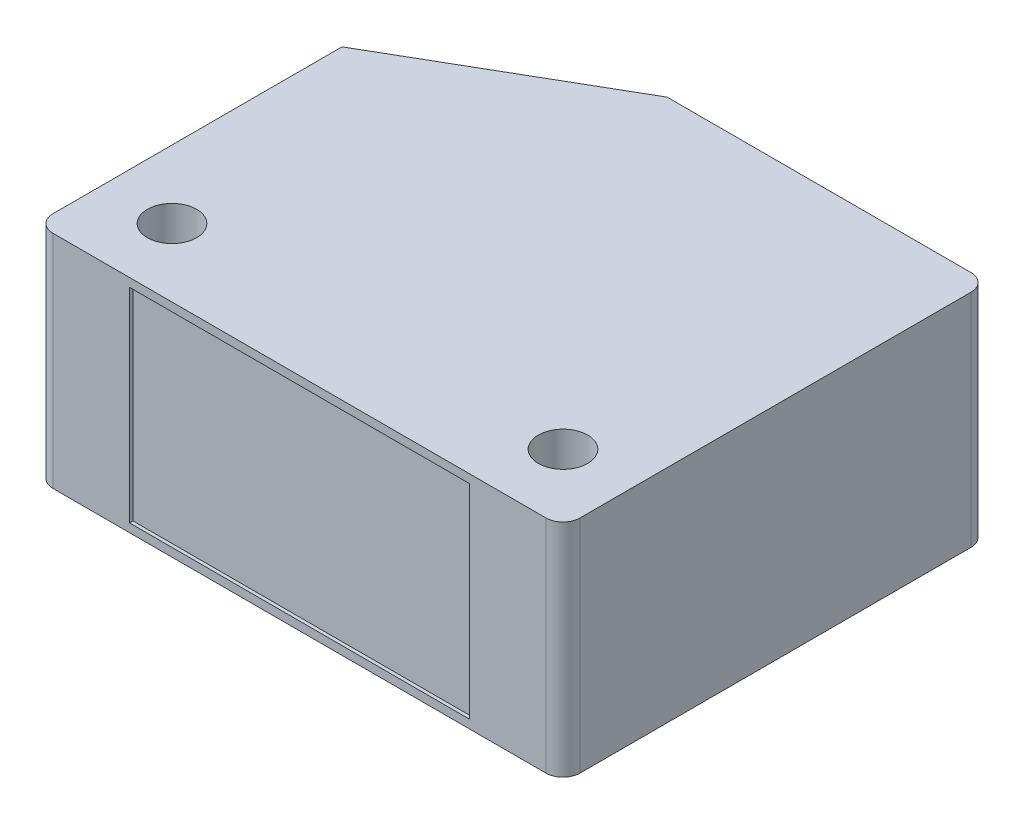
ISO-10303-21;
HEADER;
FILE_DESCRIPTION(('STEP AP214'),'2;1');
FILE_NAME('part.step','',(''),(''),'','','');
FILE_SCHEMA(('AUTOMOTIVE_DESIGN { 1 0 10303 214 1 1 1 1 }'));
ENDSEC;
DATA;
#1=APPLICATION_CONTEXT('core data for automotive mechanical design processes');
#2=APPLICATION_PROTOCOL_DEFINITION('international standard','automotive_design',2000,#1);
#3=PRODUCT_CONTEXT('',#1,'mechanical');
#4=PRODUCT('Part','Part','',(#3));
#5=PRODUCT_RELATED_PRODUCT_CATEGORY('part','',(#4));
#6=PRODUCT_DEFINITION_FORMATION('','',#4);
#7=PRODUCT_DEFINITION_CONTEXT('part definition',#1,'design');
#8=PRODUCT_DEFINITION('design','',#6,#7);
#9=PRODUCT_DEFINITION_SHAPE('','',#8);
#10=(LENGTH_UNIT() NAMED_UNIT(*) SI_UNIT(.MILLI.,.METRE.));
#11=(NAMED_UNIT(*) PLANE_ANGLE_UNIT() SI_UNIT($,.RADIAN.));
#12=(NAMED_UNIT(*) SI_UNIT($,.STERADIAN.) SOLID_ANGLE_UNIT());
#13=UNCERTAINTY_MEASURE_WITH_UNIT(LENGTH_MEASURE(1.E-05),#10,'distance_accuracy_value','');
#14=(GEOMETRIC_REPRESENTATION_CONTEXT(3) GLOBAL_UNCERTAINTY_ASSIGNED_CONTEXT((#13)) GLOBAL_UNIT_ASSIGNED_CONTEXT((#10,
#11,#12)) REPRESENTATION_CONTEXT('',''));
#15=CARTESIAN_POINT('',(0.,0.,0.));
#16=DIRECTION('',(0.,0.,1.));
#17=DIRECTION('',(1.,0.,0.));
#18=AXIS2_PLACEMENT_3D('',#15,#16,#17);
#19=CARTESIAN_POINT('',(0.,13.,0.));
#20=DIRECTION('',(0.,1.,0.));
#21=DIRECTION('',(0.,0.,1.));
#22=AXIS2_PLACEMENT_3D('',#19,#20,#21);
#23=PLANE('',#22);
#24=DIRECTION('',(0.,0.,1.));
#25=VECTOR('',#24,1.);
#26=CARTESIAN_POINT('',(-15.5,13.,-11.0605162708835));
#27=LINE('',#26,#25);
#28=CARTESIAN_POINT('',(-15.5,13.,-4.06051627088352));
#29=VERTEX_POINT('',#28);
#30=CARTESIAN_POINT('',(-15.5,13.,12.9394837291165));
#31=VERTEX_POINT('',#30);
#32=EDGE_CURVE('E206',#29,#31,#27,.T.);
#33=ORIENTED_EDGE('',*,*,#32,.T.);
#34=CARTESIAN_POINT('',(-14.5,13.,12.9394837291165));
#35=DIRECTION('',(0.,1.,0.));
#36=DIRECTION('',(0.,0.,1.));
#37=AXIS2_PLACEMENT_3D('',#34,#35,#36);
#38=CIRCLE('',#37,1.);
#39=CARTESIAN_POINT('',(-14.5,13.,13.9394837291165));
#40=VERTEX_POINT('',#39);
#41=EDGE_CURVE('E232',#31,#40,#38,.T.);
#42=ORIENTED_EDGE('',*,*,#41,.T.);
#43=DIRECTION('',(1.,0.,0.));
#44=VECTOR('',#43,1.);
#45=CARTESIAN_POINT('',(-15.5,13.,13.9394837291165));
#46=LINE('',#45,#44);
#47=CARTESIAN_POINT('',(14.5,13.,13.9394837291165));
#48=VERTEX_POINT('',#47);
#49=EDGE_CURVE('E209',#40,#48,#46,.T.);
#50=ORIENTED_EDGE('',*,*,#49,.T.);
#51=CARTESIAN_POINT('',(14.5,13.,12.9394837291165));
#52=DIRECTION('',(0.,1.,0.));
#53=DIRECTION('',(0.,0.,1.));
#54=AXIS2_PLACEMENT_3D('',#51,#52,#53);
#55=CIRCLE('',#54,1.);
#56=CARTESIAN_POINT('',(15.5,13.,12.9394837291165));
#57=VERTEX_POINT('',#56);
#58=EDGE_CURVE('E229',#48,#57,#55,.T.);
#59=ORIENTED_EDGE('',*,*,#58,.T.);
#60=DIRECTION('',(0.,0.,-1.));
#61=VECTOR('',#60,1.);
#62=CARTESIAN_POINT('',(15.5,13.,-11.0605162708835));
#63=LINE('',#62,#61);
#64=CARTESIAN_POINT('',(15.5,13.,-10.0605162708835));
#65=VERTEX_POINT('',#64);
#66=EDGE_CURVE('E201',#57,#65,#63,.T.);
#67=ORIENTED_EDGE('',*,*,#66,.T.);
#68=CARTESIAN_POINT('',(14.5,13.,-10.0605162708835));
#69=DIRECTION('',(0.,1.,0.));
#70=DIRECTION('',(0.,0.,1.));
#71=AXIS2_PLACEMENT_3D('',#68,#69,#70);
#72=CIRCLE('',#71,1.);
#73=CARTESIAN_POINT('',(14.5,13.,-11.0605162708835));
#74=VERTEX_POINT('',#73);
#75=EDGE_CURVE('E53',#65,#74,#72,.T.);
#76=ORIENTED_EDGE('',*,*,#75,.T.);
#77=DIRECTION('',(-1.,0.,0.));
#78=VECTOR('',#77,1.);
#79=CARTESIAN_POINT('',(-15.5,13.,-11.0605162708835));
#80=LINE('',#79,#78);
#81=CARTESIAN_POINT('',(-3.37564434701791,13.,-11.0605162708835));
#82=VERTEX_POINT('',#81);
#83=EDGE_CURVE('E203',#74,#82,#80,.T.);
#84=ORIENTED_EDGE('',*,*,#83,.T.);
#85=DIRECTION('',(0.866025403784438,0.,-0.500000000000001));
#86=VECTOR('',#85,1.);
#87=CARTESIAN_POINT('',(-15.5,13.,-4.06051627088352));
#88=LINE('',#87,#86);
#89=EDGE_CURVE('E145',#29,#82,#88,.T.);
#90=ORIENTED_EDGE('',*,*,#89,.F.);
#91=EDGE_LOOP('',(#33,#42,#50,#59,#67,#76,#84,#90));
#92=FACE_BOUND('',#91,.T.);
#93=CARTESIAN_POINT('',(-11.5,13.,9.93948372911649));
#94=DIRECTION('',(0.,1.,0.));
#95=DIRECTION('',(0.,0.,1.));
#96=AXIS2_PLACEMENT_3D('',#93,#94,#95);
#97=CIRCLE('',#96,1.45);
#98=CARTESIAN_POINT('',(-11.5,13.,11.3894837291165));
#99=VERTEX_POINT('',#98);
#100=EDGE_CURVE('E196',#99,#99,#97,.T.);
#101=ORIENTED_EDGE('',*,*,#100,.F.);
#102=EDGE_LOOP('',(#101));
#103=FACE_BOUND('',#102,.T.);
#104=CARTESIAN_POINT('',(11.5,13.,9.93948372911649));
#105=DIRECTION('',(0.,1.,0.));
#106=DIRECTION('',(0.,0.,1.));
#107=AXIS2_PLACEMENT_3D('',#104,#105,#106);
#108=CIRCLE('',#107,1.45);
#109=CARTESIAN_POINT('',(11.5,13.,11.3894837291165));
#110=VERTEX_POINT('',#109);
#111=EDGE_CURVE('E190',#110,#110,#108,.T.);
#112=ORIENTED_EDGE('',*,*,#111,.F.);
#113=EDGE_LOOP('',(#112));
#114=FACE_BOUND('',#113,.T.);
#115=ADVANCED_FACE('F38',(#92,#103,#114),#23,.T.);
#116=CARTESIAN_POINT('',(0.,0.,0.));
#117=DIRECTION('',(0.,1.,0.));
#118=DIRECTION('',(0.,0.,1.));
#119=AXIS2_PLACEMENT_3D('',#116,#117,#118);
#120=PLANE('',#119);
#121=DIRECTION('',(1.,0.,0.));
#122=VECTOR('',#121,1.);
#123=CARTESIAN_POINT('',(-15.5,0.,13.9394837291165));
#124=LINE('',#123,#122);
#125=CARTESIAN_POINT('',(-14.5,0.,13.9394837291165));
#126=VERTEX_POINT('',#125);
#127=CARTESIAN_POINT('',(14.5,0.,13.9394837291165));
#128=VERTEX_POINT('',#127);
#129=EDGE_CURVE('E204',#126,#128,#124,.T.);
#130=ORIENTED_EDGE('',*,*,#129,.F.);
#131=CARTESIAN_POINT('',(-14.5,0.,12.9394837291165));
#132=DIRECTION('',(0.,1.,0.));
#133=DIRECTION('',(0.,0.,1.));
#134=AXIS2_PLACEMENT_3D('',#131,#132,#133);
#135=CIRCLE('',#134,1.);
#136=CARTESIAN_POINT('',(-15.5,0.,12.9394837291165));
#137=VERTEX_POINT('',#136);
#138=EDGE_CURVE('E225',#126,#137,#135,.F.);
#139=ORIENTED_EDGE('',*,*,#138,.T.);
#140=DIRECTION('',(0.,0.,1.));
#141=VECTOR('',#140,1.);
#142=CARTESIAN_POINT('',(-15.5,0.,-11.0605162708835));
#143=LINE('',#142,#141);
#144=CARTESIAN_POINT('',(-15.5,0.,-4.06051627088352));
#145=VERTEX_POINT('',#144);
#146=EDGE_CURVE('E136',#145,#137,#143,.T.);
#147=ORIENTED_EDGE('',*,*,#146,.F.);
#148=DIRECTION('',(0.866025403784438,0.,-0.500000000000001));
#149=VECTOR('',#148,1.);
#150=CARTESIAN_POINT('',(-15.5,0.,-4.06051627088352));
#151=LINE('',#150,#149);
#152=CARTESIAN_POINT('',(-3.37564434701791,0.,-11.0605162708835));
#153=VERTEX_POINT('',#152);
#154=EDGE_CURVE('E142',#145,#153,#151,.T.);
#155=ORIENTED_EDGE('',*,*,#154,.T.);
#156=DIRECTION('',(-1.,0.,0.));
#157=VECTOR('',#156,1.);
#158=CARTESIAN_POINT('',(-15.5,0.,-11.0605162708835));
#159=LINE('',#158,#157);
#160=CARTESIAN_POINT('',(14.5,0.,-11.0605162708835));
#161=VERTEX_POINT('',#160);
#162=EDGE_CURVE('E128',#161,#153,#159,.T.);
#163=ORIENTED_EDGE('',*,*,#162,.F.);
#164=CARTESIAN_POINT('',(14.5,0.,-10.0605162708835));
#165=DIRECTION('',(0.,1.,0.));
#166=DIRECTION('',(0.,0.,1.));
#167=AXIS2_PLACEMENT_3D('',#164,#165,#166);
#168=CIRCLE('',#167,1.);
#169=CARTESIAN_POINT('',(15.5,0.,-10.0605162708835));
#170=VERTEX_POINT('',#169);
#171=EDGE_CURVE('E223',#161,#170,#168,.F.);
#172=ORIENTED_EDGE('',*,*,#171,.T.);
#173=DIRECTION('',(0.,0.,-1.));
#174=VECTOR('',#173,1.);
#175=CARTESIAN_POINT('',(15.5,0.,-11.0605162708835));
#176=LINE('',#175,#174);
#177=CARTESIAN_POINT('',(15.5,0.,12.9394837291165));
#178=VERTEX_POINT('',#177);
#179=EDGE_CURVE('E137',#178,#170,#176,.T.);
#180=ORIENTED_EDGE('',*,*,#179,.F.);
#181=CARTESIAN_POINT('',(14.5,0.,12.9394837291165));
#182=DIRECTION('',(0.,1.,0.));
#183=DIRECTION('',(0.,0.,1.));
#184=AXIS2_PLACEMENT_3D('',#181,#182,#183);
#185=CIRCLE('',#184,1.);
#186=EDGE_CURVE('E221',#178,#128,#185,.F.);
#187=ORIENTED_EDGE('',*,*,#186,.T.);
#188=EDGE_LOOP('',(#130,#139,#147,#155,#163,#172,#180,#187));
#189=FACE_BOUND('',#188,.T.);
#190=CARTESIAN_POINT('',(-11.5,0.,9.93948372911649));
#191=DIRECTION('',(0.,1.,0.));
#192=DIRECTION('',(0.,0.,1.));
#193=AXIS2_PLACEMENT_3D('',#190,#191,#192);
#194=CIRCLE('',#193,1.45);
#195=CARTESIAN_POINT('',(-11.5,0.,11.3894837291165));
#196=VERTEX_POINT('',#195);
#197=EDGE_CURVE('E193',#196,#196,#194,.T.);
#198=ORIENTED_EDGE('',*,*,#197,.T.);
#199=EDGE_LOOP('',(#198));
#200=FACE_BOUND('',#199,.T.);
#201=CARTESIAN_POINT('',(11.5,0.,9.93948372911649));
#202=DIRECTION('',(0.,1.,0.));
#203=DIRECTION('',(0.,0.,1.));
#204=AXIS2_PLACEMENT_3D('',#201,#202,#203);
#205=CIRCLE('',#204,1.45);
#206=CARTESIAN_POINT('',(11.5,0.,11.3894837291165));
#207=VERTEX_POINT('',#206);
#208=EDGE_CURVE('E183',#207,#207,#205,.T.);
#209=ORIENTED_EDGE('',*,*,#208,.T.);
#210=EDGE_LOOP('',(#209));
#211=FACE_BOUND('',#210,.T.);
#212=ADVANCED_FACE('F151',(#189,#200,#211),#120,.F.);
#213=CARTESIAN_POINT('',(15.5,13.,-11.0605162708835));
#214=DIRECTION('',(-1.,0.,0.));
#215=DIRECTION('',(0.,0.,1.));
#216=AXIS2_PLACEMENT_3D('',#213,#214,#215);
#217=PLANE('',#216);
#218=ORIENTED_EDGE('',*,*,#179,.T.);
#219=DIRECTION('',(0.,-1.,0.));
#220=VECTOR('',#219,1.);
#221=CARTESIAN_POINT('',(15.5,13.,-10.0605162708835));
#222=LINE('',#221,#220);
#223=EDGE_CURVE('E11',#170,#65,#222,.F.);
#224=ORIENTED_EDGE('',*,*,#223,.T.);
#225=ORIENTED_EDGE('',*,*,#66,.F.);
#226=DIRECTION('',(0.,-1.,0.));
#227=VECTOR('',#226,1.);
#228=CARTESIAN_POINT('',(15.5,13.,12.9394837291165));
#229=LINE('',#228,#227);
#230=EDGE_CURVE('E46',#57,#178,#229,.T.);
#231=ORIENTED_EDGE('',*,*,#230,.T.);
#232=EDGE_LOOP('',(#218,#224,#225,#231));
#233=FACE_BOUND('',#232,.T.);
#234=ADVANCED_FACE('F237',(#233),#217,.F.);
#235=CARTESIAN_POINT('',(-15.5,13.,-11.0605162708835));
#236=DIRECTION('',(0.,0.,1.));
#237=DIRECTION('',(1.,0.,0.));
#238=AXIS2_PLACEMENT_3D('',#235,#236,#237);
#239=PLANE('',#238);
#240=ORIENTED_EDGE('',*,*,#83,.F.);
#241=DIRECTION('',(0.,-1.,0.));
#242=VECTOR('',#241,1.);
#243=CARTESIAN_POINT('',(14.5,13.,-11.0605162708835));
#244=LINE('',#243,#242);
#245=EDGE_CURVE('E133',#74,#161,#244,.T.);
#246=ORIENTED_EDGE('',*,*,#245,.T.);
#247=ORIENTED_EDGE('',*,*,#162,.T.);
#248=DIRECTION('',(0.,1.,0.));
#249=VECTOR('',#248,1.);
#250=CARTESIAN_POINT('',(-3.37564434701791,0.,-11.0605162708835));
#251=LINE('',#250,#249);
#252=EDGE_CURVE('E131',#153,#82,#251,.T.);
#253=ORIENTED_EDGE('',*,*,#252,.T.);
#254=EDGE_LOOP('',(#240,#246,#247,#253));
#255=FACE_BOUND('',#254,.T.);
#256=ADVANCED_FACE('F130',(#255),#239,.F.);
#257=CARTESIAN_POINT('',(-15.5,13.,-11.0605162708835));
#258=DIRECTION('',(1.,0.,0.));
#259=DIRECTION('',(0.,0.,-1.));
#260=AXIS2_PLACEMENT_3D('',#257,#258,#259);
#261=PLANE('',#260);
#262=ORIENTED_EDGE('',*,*,#146,.T.);
#263=DIRECTION('',(0.,-1.,0.));
#264=VECTOR('',#263,1.);
#265=CARTESIAN_POINT('',(-15.5,13.,12.9394837291165));
#266=LINE('',#265,#264);
#267=EDGE_CURVE('E227',#137,#31,#266,.F.);
#268=ORIENTED_EDGE('',*,*,#267,.T.);
#269=ORIENTED_EDGE('',*,*,#32,.F.);
#270=DIRECTION('',(0.,1.,0.));
#271=VECTOR('',#270,1.);
#272=CARTESIAN_POINT('',(-15.5,0.,-4.06051627088352));
#273=LINE('',#272,#271);
#274=EDGE_CURVE('E147',#145,#29,#273,.T.);
#275=ORIENTED_EDGE('',*,*,#274,.F.);
#276=EDGE_LOOP('',(#262,#268,#269,#275));
#277=FACE_BOUND('',#276,.T.);
#278=ADVANCED_FACE('F264',(#277),#261,.F.);
#279=CARTESIAN_POINT('',(-15.5,13.,13.9394837291165));
#280=DIRECTION('',(0.,0.,-1.));
#281=DIRECTION('',(-1.,0.,0.));
#282=AXIS2_PLACEMENT_3D('',#279,#280,#281);
#283=PLANE('',#282);
#284=DIRECTION('',(-1.,0.,0.));
#285=VECTOR('',#284,1.);
#286=CARTESIAN_POINT('',(-10.,12.5,13.9394837291165));
#287=LINE('',#286,#285);
#288=CARTESIAN_POINT('',(10.,12.5,13.9394837291165));
#289=VERTEX_POINT('',#288);
#290=CARTESIAN_POINT('',(-10.,12.5,13.9394837291165));
#291=VERTEX_POINT('',#290);
#292=EDGE_CURVE('E173',#289,#291,#287,.T.);
#293=ORIENTED_EDGE('',*,*,#292,.F.);
#294=DIRECTION('',(0.,1.,0.));
#295=VECTOR('',#294,1.);
#296=CARTESIAN_POINT('',(10.,12.5,13.9394837291165));
#297=LINE('',#296,#295);
#298=CARTESIAN_POINT('',(10.,0.499999999999999,13.9394837291165));
#299=VERTEX_POINT('',#298);
#300=EDGE_CURVE('E146',#299,#289,#297,.T.);
#301=ORIENTED_EDGE('',*,*,#300,.F.);
#302=DIRECTION('',(1.,0.,0.));
#303=VECTOR('',#302,1.);
#304=CARTESIAN_POINT('',(-10.,0.5,13.9394837291165));
#305=LINE('',#304,#303);
#306=CARTESIAN_POINT('',(-10.,0.5,13.9394837291165));
#307=VERTEX_POINT('',#306);
#308=EDGE_CURVE('E162',#307,#299,#305,.T.);
#309=ORIENTED_EDGE('',*,*,#308,.F.);
#310=DIRECTION('',(0.,-1.,0.));
#311=VECTOR('',#310,1.);
#312=CARTESIAN_POINT('',(-10.,12.5,13.9394837291165));
#313=LINE('',#312,#311);
#314=EDGE_CURVE('E176',#291,#307,#313,.T.);
#315=ORIENTED_EDGE('',*,*,#314,.F.);
#316=EDGE_LOOP('',(#293,#301,#309,#315));
#317=FACE_BOUND('',#316,.T.);
#318=ORIENTED_EDGE('',*,*,#49,.F.);
#319=DIRECTION('',(0.,-1.,0.));
#320=VECTOR('',#319,1.);
#321=CARTESIAN_POINT('',(-14.5,13.,13.9394837291165));
#322=LINE('',#321,#320);
#323=EDGE_CURVE('E218',#40,#126,#322,.T.);
#324=ORIENTED_EDGE('',*,*,#323,.T.);
#325=ORIENTED_EDGE('',*,*,#129,.T.);
#326=DIRECTION('',(0.,-1.,0.));
#327=VECTOR('',#326,1.);
#328=CARTESIAN_POINT('',(14.5,13.,13.9394837291165));
#329=LINE('',#328,#327);
#330=EDGE_CURVE('E212',#128,#48,#329,.F.);
#331=ORIENTED_EDGE('',*,*,#330,.T.);
#332=EDGE_LOOP('',(#318,#324,#325,#331));
#333=FACE_BOUND('',#332,.T.);
#334=ADVANCED_FACE('F261',(#317,#333),#283,.F.);
#335=CARTESIAN_POINT('',(-11.5,13.,9.93948372911649));
#336=DIRECTION('',(0.,-1.,0.));
#337=DIRECTION('',(0.,0.,-1.));
#338=AXIS2_PLACEMENT_3D('',#335,#336,#337);
#339=CYLINDRICAL_SURFACE('',#338,1.45);
#340=ORIENTED_EDGE('',*,*,#100,.T.);
#341=EDGE_LOOP('',(#340));
#342=FACE_BOUND('',#341,.T.);
#343=ORIENTED_EDGE('',*,*,#197,.F.);
#344=EDGE_LOOP('',(#343));
#345=FACE_BOUND('',#344,.T.);
#346=ADVANCED_FACE('F258',(#342,#345),#339,.F.);
#347=CARTESIAN_POINT('',(11.5,13.,9.93948372911649));
#348=DIRECTION('',(0.,-1.,0.));
#349=DIRECTION('',(0.,0.,-1.));
#350=AXIS2_PLACEMENT_3D('',#347,#348,#349);
#351=CYLINDRICAL_SURFACE('',#350,1.45);
#352=ORIENTED_EDGE('',*,*,#111,.T.);
#353=EDGE_LOOP('',(#352));
#354=FACE_BOUND('',#353,.T.);
#355=ORIENTED_EDGE('',*,*,#208,.F.);
#356=EDGE_LOOP('',(#355));
#357=FACE_BOUND('',#356,.T.);
#358=ADVANCED_FACE('F295',(#354,#357),#351,.F.);
#359=CARTESIAN_POINT('',(10.,12.5,13.7394837291165));
#360=DIRECTION('',(1.,0.,0.));
#361=DIRECTION('',(0.,1.,0.));
#362=AXIS2_PLACEMENT_3D('',#359,#360,#361);
#363=PLANE('',#362);
#364=ORIENTED_EDGE('',*,*,#300,.T.);
#365=DIRECTION('',(0.,0.,1.));
#366=VECTOR('',#365,1.);
#367=CARTESIAN_POINT('',(10.,12.5,13.7394837291165));
#368=LINE('',#367,#366);
#369=CARTESIAN_POINT('',(10.,12.5,13.7394837291165));
#370=VERTEX_POINT('',#369);
#371=EDGE_CURVE('E171',#370,#289,#368,.T.);
#372=ORIENTED_EDGE('',*,*,#371,.F.);
#373=DIRECTION('',(0.,1.,0.));
#374=VECTOR('',#373,1.);
#375=CARTESIAN_POINT('',(10.,12.5,13.7394837291165));
#376=LINE('',#375,#374);
#377=CARTESIAN_POINT('',(10.,0.499999999999999,13.7394837291165));
#378=VERTEX_POINT('',#377);
#379=EDGE_CURVE('E158',#378,#370,#376,.T.);
#380=ORIENTED_EDGE('',*,*,#379,.F.);
#381=DIRECTION('',(0.,0.,1.));
#382=VECTOR('',#381,1.);
#383=CARTESIAN_POINT('',(10.,0.499999999999999,13.7394837291165));
#384=LINE('',#383,#382);
#385=EDGE_CURVE('E181',#378,#299,#384,.T.);
#386=ORIENTED_EDGE('',*,*,#385,.T.);
#387=EDGE_LOOP('',(#364,#372,#380,#386));
#388=FACE_BOUND('',#387,.T.);
#389=ADVANCED_FACE('F302',(#388),#363,.F.);
#390=CARTESIAN_POINT('',(-10.,0.5,13.7394837291165));
#391=DIRECTION('',(0.,-1.,0.));
#392=DIRECTION('',(1.,0.,0.));
#393=AXIS2_PLACEMENT_3D('',#390,#391,#392);
#394=PLANE('',#393);
#395=ORIENTED_EDGE('',*,*,#308,.T.);
#396=ORIENTED_EDGE('',*,*,#385,.F.);
#397=DIRECTION('',(1.,0.,0.));
#398=VECTOR('',#397,1.);
#399=CARTESIAN_POINT('',(-10.,0.5,13.7394837291165));
#400=LINE('',#399,#398);
#401=CARTESIAN_POINT('',(-10.,0.5,13.7394837291165));
#402=VERTEX_POINT('',#401);
#403=EDGE_CURVE('E168',#402,#378,#400,.T.);
#404=ORIENTED_EDGE('',*,*,#403,.F.);
#405=DIRECTION('',(0.,0.,1.));
#406=VECTOR('',#405,1.);
#407=CARTESIAN_POINT('',(-10.,0.5,13.7394837291165));
#408=LINE('',#407,#406);
#409=EDGE_CURVE('E184',#402,#307,#408,.T.);
#410=ORIENTED_EDGE('',*,*,#409,.T.);
#411=EDGE_LOOP('',(#395,#396,#404,#410));
#412=FACE_BOUND('',#411,.T.);
#413=ADVANCED_FACE('F309',(#412),#394,.F.);
#414=CARTESIAN_POINT('',(-10.,12.5,13.7394837291165));
#415=DIRECTION('',(-1.,0.,0.));
#416=DIRECTION('',(0.,-1.,0.));
#417=AXIS2_PLACEMENT_3D('',#414,#415,#416);
#418=PLANE('',#417);
#419=ORIENTED_EDGE('',*,*,#314,.T.);
#420=ORIENTED_EDGE('',*,*,#409,.F.);
#421=DIRECTION('',(0.,-1.,0.));
#422=VECTOR('',#421,1.);
#423=CARTESIAN_POINT('',(-10.,12.5,13.7394837291165));
#424=LINE('',#423,#422);
#425=CARTESIAN_POINT('',(-10.,12.5,13.7394837291165));
#426=VERTEX_POINT('',#425);
#427=EDGE_CURVE('E165',#426,#402,#424,.T.);
#428=ORIENTED_EDGE('',*,*,#427,.F.);
#429=DIRECTION('',(0.,0.,1.));
#430=VECTOR('',#429,1.);
#431=CARTESIAN_POINT('',(-10.,12.5,13.7394837291165));
#432=LINE('',#431,#430);
#433=EDGE_CURVE('E186',#426,#291,#432,.T.);
#434=ORIENTED_EDGE('',*,*,#433,.T.);
#435=EDGE_LOOP('',(#419,#420,#428,#434));
#436=FACE_BOUND('',#435,.T.);
#437=ADVANCED_FACE('F317',(#436),#418,.F.);
#438=CARTESIAN_POINT('',(-10.,12.5,13.7394837291165));
#439=DIRECTION('',(0.,1.,0.));
#440=DIRECTION('',(0.,0.,1.));
#441=AXIS2_PLACEMENT_3D('',#438,#439,#440);
#442=PLANE('',#441);
#443=ORIENTED_EDGE('',*,*,#292,.T.);
#444=ORIENTED_EDGE('',*,*,#433,.F.);
#445=DIRECTION('',(-1.,0.,0.));
#446=VECTOR('',#445,1.);
#447=CARTESIAN_POINT('',(-10.,12.5,13.7394837291165));
#448=LINE('',#447,#446);
#449=EDGE_CURVE('E161',#370,#426,#448,.T.);
#450=ORIENTED_EDGE('',*,*,#449,.F.);
#451=ORIENTED_EDGE('',*,*,#371,.T.);
#452=EDGE_LOOP('',(#443,#444,#450,#451));
#453=FACE_BOUND('',#452,.T.);
#454=ADVANCED_FACE('F325',(#453),#442,.F.);
#455=CARTESIAN_POINT('',(0.,0.,13.7394837291165));
#456=DIRECTION('',(0.,0.,1.));
#457=DIRECTION('',(1.,0.,0.));
#458=AXIS2_PLACEMENT_3D('',#455,#456,#457);
#459=PLANE('',#458);
#460=ORIENTED_EDGE('',*,*,#379,.T.);
#461=ORIENTED_EDGE('',*,*,#449,.T.);
#462=ORIENTED_EDGE('',*,*,#427,.T.);
#463=ORIENTED_EDGE('',*,*,#403,.T.);
#464=EDGE_LOOP('',(#460,#461,#462,#463));
#465=FACE_BOUND('',#464,.T.);
#466=ADVANCED_FACE('F333',(#465),#459,.T.);
#467=CARTESIAN_POINT('',(-15.5,0.,-4.06051627088352));
#468=DIRECTION('',(0.500000000000001,0.,0.866025403784438));
#469=DIRECTION('',(0.866025403784438,0.,-0.500000000000001));
#470=AXIS2_PLACEMENT_3D('',#467,#468,#469);
#471=PLANE('',#470);
#472=ORIENTED_EDGE('',*,*,#89,.T.);
#473=ORIENTED_EDGE('',*,*,#252,.F.);
#474=ORIENTED_EDGE('',*,*,#154,.F.);
#475=ORIENTED_EDGE('',*,*,#274,.T.);
#476=EDGE_LOOP('',(#472,#473,#474,#475));
#477=FACE_BOUND('',#476,.T.);
#478=ADVANCED_FACE('F141',(#477),#471,.F.);
#479=CARTESIAN_POINT('',(-14.5,13.,12.9394837291165));
#480=DIRECTION('',(0.,-1.,0.));
#481=DIRECTION('',(0.,0.,-1.));
#482=AXIS2_PLACEMENT_3D('',#479,#480,#481);
#483=CYLINDRICAL_SURFACE('',#482,1.);
#484=ORIENTED_EDGE('',*,*,#41,.F.);
#485=ORIENTED_EDGE('',*,*,#267,.F.);
#486=ORIENTED_EDGE('',*,*,#138,.F.);
#487=ORIENTED_EDGE('',*,*,#323,.F.);
#488=EDGE_LOOP('',(#484,#485,#486,#487));
#489=FACE_BOUND('',#488,.T.);
#490=ADVANCED_FACE('F243',(#489),#483,.T.);
#491=CARTESIAN_POINT('',(14.5,13.,-10.0605162708835));
#492=DIRECTION('',(0.,-1.,0.));
#493=DIRECTION('',(0.,0.,-1.));
#494=AXIS2_PLACEMENT_3D('',#491,#492,#493);
#495=CYLINDRICAL_SURFACE('',#494,1.);
#496=ORIENTED_EDGE('',*,*,#75,.F.);
#497=ORIENTED_EDGE('',*,*,#223,.F.);
#498=ORIENTED_EDGE('',*,*,#171,.F.);
#499=ORIENTED_EDGE('',*,*,#245,.F.);
#500=EDGE_LOOP('',(#496,#497,#498,#499));
#501=FACE_BOUND('',#500,.T.);
#502=ADVANCED_FACE('F241',(#501),#495,.T.);
#503=CARTESIAN_POINT('',(14.5,13.,12.9394837291165));
#504=DIRECTION('',(0.,-1.,0.));
#505=DIRECTION('',(0.,0.,-1.));
#506=AXIS2_PLACEMENT_3D('',#503,#504,#505);
#507=CYLINDRICAL_SURFACE('',#506,1.);
#508=ORIENTED_EDGE('',*,*,#58,.F.);
#509=ORIENTED_EDGE('',*,*,#330,.F.);
#510=ORIENTED_EDGE('',*,*,#186,.F.);
#511=ORIENTED_EDGE('',*,*,#230,.F.);
#512=EDGE_LOOP('',(#508,#509,#510,#511));
#513=FACE_BOUND('',#512,.T.);
#514=ADVANCED_FACE('F40',(#513),#507,.T.);
#515=CLOSED_SHELL('',(#115,#212,#234,#256,#278,#334,#346,#358,#389,#413,#437,#454,#466,#478,
#490,#502,#514));
#516=MANIFOLD_SOLID_BREP('B2',#515);
#517=ADVANCED_BREP_SHAPE_REPRESENTATION('',(#18,#516),#14);
#518=SHAPE_DEFINITION_REPRESENTATION(#9,#517);
ENDSEC;
END-ISO-10303-21;
